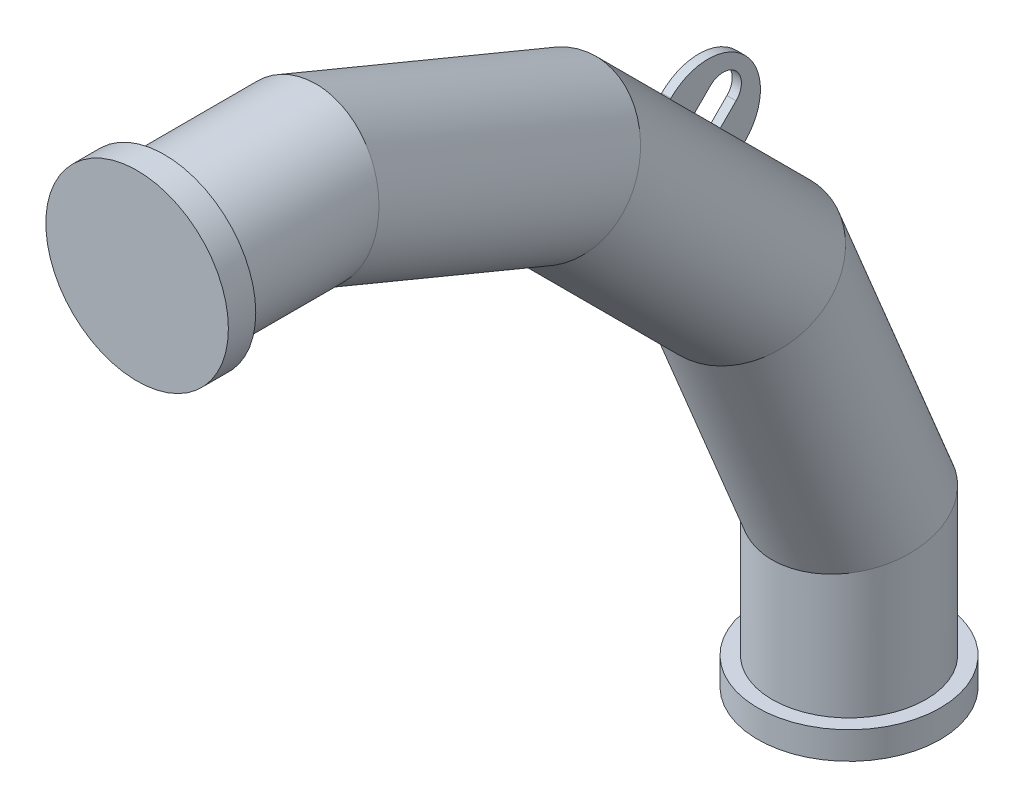
ISO-10303-21;
HEADER;
FILE_DESCRIPTION(('STEP AP214'),'2;1');
FILE_NAME('part.step','',(''),(''),'','','');
FILE_SCHEMA(('AUTOMOTIVE_DESIGN { 1 0 10303 214 1 1 1 1 }'));
ENDSEC;
DATA;
#1=APPLICATION_CONTEXT('core data for automotive mechanical design processes');
#2=APPLICATION_PROTOCOL_DEFINITION('international standard','automotive_design',2000,#1);
#3=PRODUCT_CONTEXT('',#1,'mechanical');
#4=PRODUCT('Part','Part','',(#3));
#5=PRODUCT_RELATED_PRODUCT_CATEGORY('part','',(#4));
#6=PRODUCT_DEFINITION_FORMATION('','',#4);
#7=PRODUCT_DEFINITION_CONTEXT('part definition',#1,'design');
#8=PRODUCT_DEFINITION('design','',#6,#7);
#9=PRODUCT_DEFINITION_SHAPE('','',#8);
#10=(LENGTH_UNIT() NAMED_UNIT(*) SI_UNIT(.MILLI.,.METRE.));
#11=(NAMED_UNIT(*) PLANE_ANGLE_UNIT() SI_UNIT($,.RADIAN.));
#12=(NAMED_UNIT(*) SI_UNIT($,.STERADIAN.) SOLID_ANGLE_UNIT());
#13=UNCERTAINTY_MEASURE_WITH_UNIT(LENGTH_MEASURE(1.E-05),#10,'distance_accuracy_value','');
#14=(GEOMETRIC_REPRESENTATION_CONTEXT(3) GLOBAL_UNCERTAINTY_ASSIGNED_CONTEXT((#13)) GLOBAL_UNIT_ASSIGNED_CONTEXT((#10,
#11,#12)) REPRESENTATION_CONTEXT('',''));
#15=CARTESIAN_POINT('',(0.,0.,0.));
#16=DIRECTION('',(0.,0.,1.));
#17=DIRECTION('',(1.,0.,0.));
#18=AXIS2_PLACEMENT_3D('',#15,#16,#17);
#19=CARTESIAN_POINT('',(0.,-325.159126987109,-665.81929876693));
#20=DIRECTION('',(0.,0.707106781186547,0.707106781186548));
#21=DIRECTION('',(0.,-0.707106781186548,0.707106781186547));
#22=AXIS2_PLACEMENT_3D('',#19,#20,#21);
#23=CYLINDRICAL_SURFACE('',#22,84.15);
#24=CARTESIAN_POINT('',(0.,-205.527778486358,-546.18795026618));
#25=DIRECTION('',(0.,0.707106781186549,0.707106781186549));
#26=DIRECTION('',(0.,-0.707106781186548,0.707106781186547));
#27=AXIS2_PLACEMENT_3D('',#24,#25,#26);
#28=CIRCLE('',#27,84.15);
#29=CARTESIAN_POINT('',(5.00000000000001,-146.129872378483,-605.585856374055));
#30=VERTEX_POINT('',#29);
#31=CARTESIAN_POINT('',(-4.99999999999999,-146.129872378483,-605.585856374055));
#32=VERTEX_POINT('',#31);
#33=EDGE_CURVE('E368',#30,#32,#28,.T.);
#34=ORIENTED_EDGE('',*,*,#33,.F.);
#35=DIRECTION('',(0.,0.707106781186547,0.707106781186548));
#36=VECTOR('',#35,1.);
#37=CARTESIAN_POINT('',(5.00000000000001,-265.761220879233,-725.217204874806));
#38=LINE('',#37,#36);
#39=CARTESIAN_POINT('',(5.00000000000001,-119.613368083987,-579.06935207956));
#40=VERTEX_POINT('',#39);
#41=EDGE_CURVE('E364',#30,#40,#38,.T.);
#42=ORIENTED_EDGE('',*,*,#41,.T.);
#43=CARTESIAN_POINT('',(0.,-179.011274191863,-519.671445971684));
#44=DIRECTION('',(0.,-0.707106781186548,-0.707106781186548));
#45=DIRECTION('',(0.,0.707106781186548,-0.707106781186548));
#46=AXIS2_PLACEMENT_3D('',#43,#44,#45);
#47=CIRCLE('',#46,84.15);
#48=CARTESIAN_POINT('',(-5.,-119.613368083987,-579.06935207956));
#49=VERTEX_POINT('',#48);
#50=EDGE_CURVE('E356',#49,#40,#47,.T.);
#51=ORIENTED_EDGE('',*,*,#50,.F.);
#52=DIRECTION('',(0.,0.707106781186547,0.707106781186548));
#53=VECTOR('',#52,1.);
#54=CARTESIAN_POINT('',(-5.,-265.761220879233,-725.217204874806));
#55=LINE('',#54,#53);
#56=EDGE_CURVE('E360',#32,#49,#55,.T.);
#57=ORIENTED_EDGE('',*,*,#56,.F.);
#58=EDGE_LOOP('',(#34,#42,#51,#57));
#59=FACE_BOUND('',#58,.T.);
#60=CARTESIAN_POINT('',(0.,-325.159126987114,-665.819298766927));
#61=DIRECTION('',(0.,0.831469612302548,0.555570233019599));
#62=DIRECTION('',(0.,-0.555570233019599,0.831469612302548));
#63=AXIS2_PLACEMENT_3D('',#60,#61,#62);
#64=ELLIPSE('',#63,85.79859596323,84.15);
#65=CARTESIAN_POINT('',(0.,-372.82627293916,-594.480373445277));
#66=VERTEX_POINT('',#65);
#67=EDGE_CURVE('E345',#66,#66,#64,.T.);
#68=ORIENTED_EDGE('',*,*,#67,.T.);
#69=EDGE_LOOP('',(#68));
#70=FACE_BOUND('',#69,.T.);
#71=CARTESIAN_POINT('',(0.,-114.18070123307,-454.840873012891));
#72=DIRECTION('',(0.,0.555570233019602,0.831469612302545));
#73=DIRECTION('',(0.,0.831469612302545,-0.555570233019602));
#74=AXIS2_PLACEMENT_3D('',#71,#72,#73);
#75=ELLIPSE('',#74,85.79859596323,84.15);
#76=CARTESIAN_POINT('',(0.,-42.8417759114201,-502.508018964937));
#77=VERTEX_POINT('',#76);
#78=EDGE_CURVE('E341',#77,#77,#75,.T.);
#79=ORIENTED_EDGE('',*,*,#78,.F.);
#80=EDGE_LOOP('',(#79));
#81=FACE_BOUND('',#80,.T.);
#82=CARTESIAN_POINT('',(0.,-233.81204973382,-574.472221513642));
#83=DIRECTION('',(0.,-0.707106781186548,-0.707106781186549));
#84=DIRECTION('',(0.,0.707106781186548,-0.707106781186547));
#85=AXIS2_PLACEMENT_3D('',#82,#83,#84);
#86=CIRCLE('',#85,84.15);
#87=CARTESIAN_POINT('',(-4.99999999999999,-174.414143625945,-633.870127621517));
#88=VERTEX_POINT('',#87);
#89=CARTESIAN_POINT('',(5.00000000000001,-174.414143625945,-633.870127621517));
#90=VERTEX_POINT('',#89);
#91=EDGE_CURVE('E11',#88,#90,#86,.T.);
#92=ORIENTED_EDGE('',*,*,#91,.F.);
#93=CARTESIAN_POINT('',(-5.,-200.93064792044,-660.386631916013));
#94=VERTEX_POINT('',#93);
#95=EDGE_CURVE('E365',#94,#88,#55,.T.);
#96=ORIENTED_EDGE('',*,*,#95,.F.);
#97=CARTESIAN_POINT('',(0.,-260.328554028316,-600.988725808137));
#98=DIRECTION('',(0.,0.707106781186548,0.707106781186548));
#99=DIRECTION('',(0.,-0.707106781186548,0.707106781186548));
#100=AXIS2_PLACEMENT_3D('',#97,#98,#99);
#101=CIRCLE('',#100,84.15);
#102=CARTESIAN_POINT('',(5.00000000000001,-200.93064792044,-660.386631916013));
#103=VERTEX_POINT('',#102);
#104=EDGE_CURVE('E371',#103,#94,#101,.T.);
#105=ORIENTED_EDGE('',*,*,#104,.F.);
#106=EDGE_CURVE('E28',#103,#90,#38,.T.);
#107=ORIENTED_EDGE('',*,*,#106,.T.);
#108=EDGE_LOOP('',(#92,#96,#105,#107));
#109=FACE_BOUND('',#108,.T.);
#110=ADVANCED_FACE('F18',(#59,#70,#81,#109),#23,.T.);
#111=CARTESIAN_POINT('',(0.,-600.815724465262,-779.999999999995));
#112=DIRECTION('',(0.,-1.,0.));
#113=DIRECTION('',(-1.,0.,0.));
#114=AXIS2_PLACEMENT_3D('',#111,#112,#113);
#115=CYLINDRICAL_SURFACE('',#114,84.15);
#116=CARTESIAN_POINT('',(0.,-750.000000000005,-779.999999999995));
#117=DIRECTION('',(0.,1.,0.));
#118=DIRECTION('',(1.,0.,0.));
#119=AXIS2_PLACEMENT_3D('',#116,#117,#118);
#120=CIRCLE('',#119,84.15);
#121=CARTESIAN_POINT('',(84.1500000000002,-750.000000000005,-779.999999999995));
#122=VERTEX_POINT('',#121);
#123=EDGE_CURVE('E336',#122,#122,#120,.T.);
#124=ORIENTED_EDGE('',*,*,#123,.T.);
#125=EDGE_LOOP('',(#124));
#126=FACE_BOUND('',#125,.T.);
#127=CARTESIAN_POINT('',(0.,-600.815724465262,-779.999999999995));
#128=DIRECTION('',(0.,0.980785280403231,0.195090322016124));
#129=DIRECTION('',(0.,-0.195090322016124,0.980785280403231));
#130=AXIS2_PLACEMENT_3D('',#127,#128,#129);
#131=ELLIPSE('',#130,85.79859596323,84.15);
#132=CARTESIAN_POINT('',(0.,-617.55420018026,-695.849999999995));
#133=VERTEX_POINT('',#132);
#134=EDGE_CURVE('E349',#133,#133,#131,.T.);
#135=ORIENTED_EDGE('',*,*,#134,.F.);
#136=EDGE_LOOP('',(#135));
#137=FACE_BOUND('',#136,.T.);
#138=ADVANCED_FACE('F20',(#126,#137),#115,.T.);
#139=CARTESIAN_POINT('',(0.,-325.159126987114,-665.819298766927));
#140=DIRECTION('',(0.,-0.923879532511289,-0.382683432365085));
#141=DIRECTION('',(0.,-0.382683432365085,0.923879532511289));
#142=AXIS2_PLACEMENT_3D('',#139,#140,#141);
#143=CYLINDRICAL_SURFACE('',#142,84.15);
#144=ORIENTED_EDGE('',*,*,#67,.F.);
#145=EDGE_LOOP('',(#144));
#146=FACE_BOUND('',#145,.T.);
#147=ORIENTED_EDGE('',*,*,#134,.T.);
#148=EDGE_LOOP('',(#147));
#149=FACE_BOUND('',#148,.T.);
#150=ADVANCED_FACE('F1005',(#146,#149),#143,.T.);
#151=CARTESIAN_POINT('',(0.,-114.18070123307,-454.840873012891));
#152=DIRECTION('',(0.,0.382683432365089,0.923879532511287));
#153=DIRECTION('',(0.,-0.923879532511287,0.382683432365089));
#154=AXIS2_PLACEMENT_3D('',#151,#152,#153);
#155=CYLINDRICAL_SURFACE('',#154,84.15);
#156=ORIENTED_EDGE('',*,*,#78,.T.);
#157=EDGE_LOOP('',(#156));
#158=FACE_BOUND('',#157,.T.);
#159=CARTESIAN_POINT('',(0.,0.,-179.184275534743));
#160=DIRECTION('',(0.,0.195090322016128,0.98078528040323));
#161=DIRECTION('',(0.,0.980785280403231,-0.195090322016128));
#162=AXIS2_PLACEMENT_3D('',#159,#160,#161);
#163=ELLIPSE('',#162,85.79859596323,84.15);
#164=CARTESIAN_POINT('',(0.,84.15,-195.922751249741));
#165=VERTEX_POINT('',#164);
#166=EDGE_CURVE('E337',#165,#165,#163,.T.);
#167=ORIENTED_EDGE('',*,*,#166,.F.);
#168=EDGE_LOOP('',(#167));
#169=FACE_BOUND('',#168,.T.);
#170=ADVANCED_FACE('F510',(#158,#169),#155,.T.);
#171=CARTESIAN_POINT('',(0.,0.,-179.184275534743));
#172=DIRECTION('',(0.,0.,1.));
#173=DIRECTION('',(1.,0.,0.));
#174=AXIS2_PLACEMENT_3D('',#171,#172,#173);
#175=CYLINDRICAL_SURFACE('',#174,84.15);
#176=CARTESIAN_POINT('',(0.,0.,-30.));
#177=DIRECTION('',(0.,0.,-1.));
#178=DIRECTION('',(-1.,0.,0.));
#179=AXIS2_PLACEMENT_3D('',#176,#177,#178);
#180=CIRCLE('',#179,84.15);
#181=CARTESIAN_POINT('',(-84.1500000000002,0.,-30.));
#182=VERTEX_POINT('',#181);
#183=EDGE_CURVE('E329',#182,#182,#180,.T.);
#184=ORIENTED_EDGE('',*,*,#183,.T.);
#185=EDGE_LOOP('',(#184));
#186=FACE_BOUND('',#185,.T.);
#187=ORIENTED_EDGE('',*,*,#166,.T.);
#188=EDGE_LOOP('',(#187));
#189=FACE_BOUND('',#188,.T.);
#190=ADVANCED_FACE('F504',(#186,#189),#175,.T.);
#191=CARTESIAN_POINT('',(0.,-750.000000000005,-779.999999999995));
#192=DIRECTION('',(0.,-1.,0.));
#193=DIRECTION('',(1.,0.,0.));
#194=AXIS2_PLACEMENT_3D('',#191,#192,#193);
#195=CYLINDRICAL_SURFACE('',#194,100.);
#196=CARTESIAN_POINT('',(0.,-750.000000000005,-779.999999999995));
#197=DIRECTION('',(0.,-1.,0.));
#198=DIRECTION('',(1.,0.,0.));
#199=AXIS2_PLACEMENT_3D('',#196,#197,#198);
#200=CIRCLE('',#199,100.);
#201=CARTESIAN_POINT('',(100.,-750.000000000005,-779.999999999995));
#202=VERTEX_POINT('',#201);
#203=EDGE_CURVE('E325',#202,#202,#200,.T.);
#204=ORIENTED_EDGE('',*,*,#203,.T.);
#205=EDGE_LOOP('',(#204));
#206=FACE_BOUND('',#205,.T.);
#207=CARTESIAN_POINT('',(0.,-780.000000000005,-779.999999999995));
#208=DIRECTION('',(0.,-1.,0.));
#209=DIRECTION('',(1.,0.,0.));
#210=AXIS2_PLACEMENT_3D('',#207,#208,#209);
#211=CIRCLE('',#210,100.);
#212=CARTESIAN_POINT('',(100.,-780.000000000005,-779.999999999995));
#213=VERTEX_POINT('',#212);
#214=EDGE_CURVE('E321',#213,#213,#211,.T.);
#215=ORIENTED_EDGE('',*,*,#214,.F.);
#216=EDGE_LOOP('',(#215));
#217=FACE_BOUND('',#216,.T.);
#218=ADVANCED_FACE('F509',(#206,#217),#195,.T.);
#219=CARTESIAN_POINT('',(0.,-750.000000000005,-779.999999999995));
#220=DIRECTION('',(0.,-1.,0.));
#221=DIRECTION('',(1.,0.,0.));
#222=AXIS2_PLACEMENT_3D('',#219,#220,#221);
#223=PLANE('',#222);
#224=ORIENTED_EDGE('',*,*,#123,.F.);
#225=EDGE_LOOP('',(#224));
#226=FACE_BOUND('',#225,.T.);
#227=ORIENTED_EDGE('',*,*,#203,.F.);
#228=EDGE_LOOP('',(#227));
#229=FACE_BOUND('',#228,.T.);
#230=ADVANCED_FACE('F529',(#226,#229),#223,.F.);
#231=CARTESIAN_POINT('',(0.,0.,-30.));
#232=DIRECTION('',(0.,0.,1.));
#233=DIRECTION('',(1.,0.,0.));
#234=AXIS2_PLACEMENT_3D('',#231,#232,#233);
#235=CYLINDRICAL_SURFACE('',#234,100.);
#236=CARTESIAN_POINT('',(0.,0.,-30.));
#237=DIRECTION('',(0.,0.,1.));
#238=DIRECTION('',(1.,0.,0.));
#239=AXIS2_PLACEMENT_3D('',#236,#237,#238);
#240=CIRCLE('',#239,100.);
#241=CARTESIAN_POINT('',(100.,0.,-30.));
#242=VERTEX_POINT('',#241);
#243=EDGE_CURVE('E318',#242,#242,#240,.T.);
#244=ORIENTED_EDGE('',*,*,#243,.T.);
#245=EDGE_LOOP('',(#244));
#246=FACE_BOUND('',#245,.T.);
#247=CARTESIAN_POINT('',(0.,0.,0.));
#248=DIRECTION('',(0.,0.,1.));
#249=DIRECTION('',(1.,0.,0.));
#250=AXIS2_PLACEMENT_3D('',#247,#248,#249);
#251=CIRCLE('',#250,100.);
#252=CARTESIAN_POINT('',(100.,0.,0.));
#253=VERTEX_POINT('',#252);
#254=EDGE_CURVE('E317',#253,#253,#251,.T.);
#255=ORIENTED_EDGE('',*,*,#254,.F.);
#256=EDGE_LOOP('',(#255));
#257=FACE_BOUND('',#256,.T.);
#258=ADVANCED_FACE('F538',(#246,#257),#235,.T.);
#259=CARTESIAN_POINT('',(0.,0.,-30.));
#260=DIRECTION('',(0.,0.,1.));
#261=DIRECTION('',(1.,0.,0.));
#262=AXIS2_PLACEMENT_3D('',#259,#260,#261);
#263=PLANE('',#262);
#264=ORIENTED_EDGE('',*,*,#183,.F.);
#265=EDGE_LOOP('',(#264));
#266=FACE_BOUND('',#265,.T.);
#267=ORIENTED_EDGE('',*,*,#243,.F.);
#268=EDGE_LOOP('',(#267));
#269=FACE_BOUND('',#268,.T.);
#270=ADVANCED_FACE('F549',(#266,#269),#263,.F.);
#271=CARTESIAN_POINT('',(5.00000000000001,-142.948828351349,-637.051171648651));
#272=DIRECTION('',(1.,0.,0.));
#273=DIRECTION('',(0.,0.707106781186549,-0.707106781186548));
#274=AXIS2_PLACEMENT_3D('',#271,#272,#273);
#275=PLANE('',#274);
#276=ORIENTED_EDGE('',*,*,#106,.F.);
#277=DIRECTION('',(0.,0.707106781186548,-0.707106781186548));
#278=VECTOR('',#277,1.);
#279=CARTESIAN_POINT('',(5.00000000000001,-207.295545439325,-654.021734397128));
#280=LINE('',#279,#278);
#281=CARTESIAN_POINT('',(5.00000000000001,-200.224477627459,-661.092802208994));
#282=VERTEX_POINT('',#281);
#283=EDGE_CURVE('E267',#103,#282,#280,.T.);
#284=ORIENTED_EDGE('',*,*,#283,.T.);
#285=CARTESIAN_POINT('',(5.00000000000001,-159.565837709233,-620.434162290767));
#286=DIRECTION('',(1.,0.,0.));
#287=DIRECTION('',(0.,0.707106781186549,-0.707106781186548));
#288=AXIS2_PLACEMENT_3D('',#285,#286,#287);
#289=CIRCLE('',#288,57.5);
#290=CARTESIAN_POINT('',(5.00000000000001,-118.907197791006,-579.775522372541));
#291=VERTEX_POINT('',#290);
#292=EDGE_CURVE('E285',#282,#291,#289,.T.);
#293=ORIENTED_EDGE('',*,*,#292,.T.);
#294=DIRECTION('',(0.,0.707106781186548,-0.707106781186548));
#295=VECTOR('',#294,1.);
#296=CARTESIAN_POINT('',(5.00000000000001,-125.978265602872,-572.704454560675));
#297=LINE('',#296,#295);
#298=EDGE_CURVE('E258',#40,#291,#297,.T.);
#299=ORIENTED_EDGE('',*,*,#298,.F.);
#300=ORIENTED_EDGE('',*,*,#41,.F.);
#301=DIRECTION('',(0.,0.707106781186549,-0.707106781186549));
#302=VECTOR('',#301,1.);
#303=CARTESIAN_POINT('',(5.00000000000001,-145.423702085502,-606.292026667036));
#304=LINE('',#303,#302);
#305=CARTESIAN_POINT('',(5.00000000000001,-128.806692727618,-622.90903602492));
#306=VERTEX_POINT('',#305);
#307=EDGE_CURVE('E274',#30,#306,#304,.T.);
#308=ORIENTED_EDGE('',*,*,#307,.T.);
#309=CARTESIAN_POINT('',(5.00000000000001,-142.948828351349,-637.051171648651));
#310=DIRECTION('',(-1.,0.,0.));
#311=DIRECTION('',(0.,0.707106781186549,-0.707106781186548));
#312=AXIS2_PLACEMENT_3D('',#309,#310,#311);
#313=CIRCLE('',#312,20.);
#314=CARTESIAN_POINT('',(5.00000000000001,-157.09096397508,-651.193307272382));
#315=VERTEX_POINT('',#314);
#316=EDGE_CURVE('E277',#306,#315,#313,.T.);
#317=ORIENTED_EDGE('',*,*,#316,.T.);
#318=DIRECTION('',(0.,-0.707106781186549,0.707106781186548));
#319=VECTOR('',#318,1.);
#320=CARTESIAN_POINT('',(5.00000000000001,-173.707973332964,-634.576297914498));
#321=LINE('',#320,#319);
#322=EDGE_CURVE('E281',#315,#90,#321,.T.);
#323=ORIENTED_EDGE('',*,*,#322,.T.);
#324=EDGE_LOOP('',(#276,#284,#293,#299,#300,#308,#317,#323));
#325=FACE_BOUND('',#324,.T.);
#326=ADVANCED_FACE('F560',(#325),#275,.T.);
#327=CARTESIAN_POINT('',(-5.,-142.948828351349,-637.051171648651));
#328=DIRECTION('',(1.,0.,0.));
#329=DIRECTION('',(0.,0.707106781186549,-0.707106781186548));
#330=AXIS2_PLACEMENT_3D('',#327,#328,#329);
#331=PLANE('',#330);
#332=DIRECTION('',(0.,0.707106781186548,-0.707106781186548));
#333=VECTOR('',#332,1.);
#334=CARTESIAN_POINT('',(-5.,-207.295545439325,-654.021734397128));
#335=LINE('',#334,#333);
#336=CARTESIAN_POINT('',(-5.,-200.22447762746,-661.092802208994));
#337=VERTEX_POINT('',#336);
#338=EDGE_CURVE('E270',#94,#337,#335,.T.);
#339=ORIENTED_EDGE('',*,*,#338,.F.);
#340=ORIENTED_EDGE('',*,*,#95,.T.);
#341=DIRECTION('',(0.,-0.707106781186549,0.707106781186548));
#342=VECTOR('',#341,1.);
#343=CARTESIAN_POINT('',(-5.,-173.707973332964,-634.576297914498));
#344=LINE('',#343,#342);
#345=CARTESIAN_POINT('',(-5.,-157.09096397508,-651.193307272382));
#346=VERTEX_POINT('',#345);
#347=EDGE_CURVE('E295',#346,#88,#344,.T.);
#348=ORIENTED_EDGE('',*,*,#347,.F.);
#349=CARTESIAN_POINT('',(-5.,-142.948828351349,-637.051171648651));
#350=DIRECTION('',(-1.,0.,0.));
#351=DIRECTION('',(0.,0.707106781186549,-0.707106781186548));
#352=AXIS2_PLACEMENT_3D('',#349,#350,#351);
#353=CIRCLE('',#352,20.);
#354=CARTESIAN_POINT('',(-5.,-128.806692727618,-622.90903602492));
#355=VERTEX_POINT('',#354);
#356=EDGE_CURVE('E292',#355,#346,#353,.T.);
#357=ORIENTED_EDGE('',*,*,#356,.F.);
#358=DIRECTION('',(0.,0.707106781186549,-0.707106781186549));
#359=VECTOR('',#358,1.);
#360=CARTESIAN_POINT('',(-5.,-145.423702085502,-606.292026667036));
#361=LINE('',#360,#359);
#362=EDGE_CURVE('E273',#32,#355,#361,.T.);
#363=ORIENTED_EDGE('',*,*,#362,.F.);
#364=ORIENTED_EDGE('',*,*,#56,.T.);
#365=DIRECTION('',(0.,0.707106781186548,-0.707106781186548));
#366=VECTOR('',#365,1.);
#367=CARTESIAN_POINT('',(-5.,-125.978265602872,-572.704454560675));
#368=LINE('',#367,#366);
#369=CARTESIAN_POINT('',(-5.,-118.907197791006,-579.775522372541));
#370=VERTEX_POINT('',#369);
#371=EDGE_CURVE('E264',#49,#370,#368,.T.);
#372=ORIENTED_EDGE('',*,*,#371,.T.);
#373=CARTESIAN_POINT('',(-5.,-159.565837709233,-620.434162290767));
#374=DIRECTION('',(1.,0.,0.));
#375=DIRECTION('',(0.,0.707106781186549,-0.707106781186548));
#376=AXIS2_PLACEMENT_3D('',#373,#374,#375);
#377=CIRCLE('',#376,57.5);
#378=EDGE_CURVE('E278',#337,#370,#377,.T.);
#379=ORIENTED_EDGE('',*,*,#378,.F.);
#380=EDGE_LOOP('',(#339,#340,#348,#357,#363,#364,#372,#379));
#381=FACE_BOUND('',#380,.T.);
#382=ADVANCED_FACE('F570',(#381),#331,.F.);
#383=CARTESIAN_POINT('',(5.00000000000001,-145.423702085502,-606.292026667036));
#384=DIRECTION('',(0.,0.707106781186549,0.707106781186549));
#385=DIRECTION('',(0.,-0.707106781186549,0.707106781186549));
#386=AXIS2_PLACEMENT_3D('',#383,#384,#385);
#387=PLANE('',#386);
#388=ORIENTED_EDGE('',*,*,#307,.F.);
#389=ORIENTED_EDGE('',*,*,#33,.T.);
#390=ORIENTED_EDGE('',*,*,#362,.T.);
#391=DIRECTION('',(-1.,0.,0.));
#392=VECTOR('',#391,1.);
#393=CARTESIAN_POINT('',(5.00000000000001,-128.806692727618,-622.90903602492));
#394=LINE('',#393,#392);
#395=EDGE_CURVE('E313',#306,#355,#394,.T.);
#396=ORIENTED_EDGE('',*,*,#395,.F.);
#397=EDGE_LOOP('',(#388,#389,#390,#396));
#398=FACE_BOUND('',#397,.T.);
#399=ADVANCED_FACE('F580',(#398),#387,.F.);
#400=CARTESIAN_POINT('',(5.00000000000001,-142.948828351349,-637.051171648651));
#401=DIRECTION('',(-1.,0.,0.));
#402=DIRECTION('',(0.,-0.707106781186549,0.707106781186548));
#403=AXIS2_PLACEMENT_3D('',#400,#401,#402);
#404=CYLINDRICAL_SURFACE('',#403,20.);
#405=ORIENTED_EDGE('',*,*,#356,.T.);
#406=DIRECTION('',(-1.,0.,0.));
#407=VECTOR('',#406,1.);
#408=CARTESIAN_POINT('',(5.00000000000001,-157.09096397508,-651.193307272382));
#409=LINE('',#408,#407);
#410=EDGE_CURVE('E309',#315,#346,#409,.T.);
#411=ORIENTED_EDGE('',*,*,#410,.F.);
#412=ORIENTED_EDGE('',*,*,#316,.F.);
#413=ORIENTED_EDGE('',*,*,#395,.T.);
#414=EDGE_LOOP('',(#405,#411,#412,#413));
#415=FACE_BOUND('',#414,.T.);
#416=ADVANCED_FACE('F489',(#415),#404,.F.);
#417=CARTESIAN_POINT('',(5.00000000000001,-173.707973332964,-634.576297914498));
#418=DIRECTION('',(0.,-0.707106781186548,-0.707106781186549));
#419=DIRECTION('',(0.,0.707106781186549,-0.707106781186548));
#420=AXIS2_PLACEMENT_3D('',#417,#418,#419);
#421=PLANE('',#420);
#422=ORIENTED_EDGE('',*,*,#347,.T.);
#423=ORIENTED_EDGE('',*,*,#91,.T.);
#424=ORIENTED_EDGE('',*,*,#322,.F.);
#425=ORIENTED_EDGE('',*,*,#410,.T.);
#426=EDGE_LOOP('',(#422,#423,#424,#425));
#427=FACE_BOUND('',#426,.T.);
#428=ADVANCED_FACE('F482',(#427),#421,.F.);
#429=CARTESIAN_POINT('',(5.00000000000001,-159.565837709233,-620.434162290767));
#430=DIRECTION('',(-1.,0.,0.));
#431=DIRECTION('',(0.,-0.707106781186549,0.707106781186548));
#432=AXIS2_PLACEMENT_3D('',#429,#430,#431);
#433=CYLINDRICAL_SURFACE('',#432,57.5);
#434=ORIENTED_EDGE('',*,*,#378,.T.);
#435=DIRECTION('',(-1.,0.,0.));
#436=VECTOR('',#435,1.);
#437=CARTESIAN_POINT('',(5.00000000000001,-118.907197791006,-579.775522372541));
#438=LINE('',#437,#436);
#439=EDGE_CURVE('E289',#291,#370,#438,.T.);
#440=ORIENTED_EDGE('',*,*,#439,.F.);
#441=ORIENTED_EDGE('',*,*,#292,.F.);
#442=DIRECTION('',(-1.,0.,0.));
#443=VECTOR('',#442,1.);
#444=CARTESIAN_POINT('',(5.00000000000001,-200.224477627459,-661.092802208994));
#445=LINE('',#444,#443);
#446=EDGE_CURVE('E305',#282,#337,#445,.T.);
#447=ORIENTED_EDGE('',*,*,#446,.T.);
#448=EDGE_LOOP('',(#434,#440,#441,#447));
#449=FACE_BOUND('',#448,.T.);
#450=ADVANCED_FACE('F488',(#449),#433,.T.);
#451=CARTESIAN_POINT('',(-5.,-207.295545439325,-654.021734397128));
#452=DIRECTION('',(0.,0.707106781186548,0.707106781186548));
#453=DIRECTION('',(0.,-0.707106781186548,0.707106781186548));
#454=AXIS2_PLACEMENT_3D('',#451,#452,#453);
#455=PLANE('',#454);
#456=ORIENTED_EDGE('',*,*,#283,.F.);
#457=ORIENTED_EDGE('',*,*,#104,.T.);
#458=ORIENTED_EDGE('',*,*,#338,.T.);
#459=ORIENTED_EDGE('',*,*,#446,.F.);
#460=EDGE_LOOP('',(#456,#457,#458,#459));
#461=FACE_BOUND('',#460,.T.);
#462=ADVANCED_FACE('F608',(#461),#455,.F.);
#463=CARTESIAN_POINT('',(5.00000000000001,-125.978265602872,-572.704454560675));
#464=DIRECTION('',(0.,-0.707106781186548,-0.707106781186548));
#465=DIRECTION('',(0.,0.707106781186548,-0.707106781186548));
#466=AXIS2_PLACEMENT_3D('',#463,#464,#465);
#467=PLANE('',#466);
#468=ORIENTED_EDGE('',*,*,#371,.F.);
#469=ORIENTED_EDGE('',*,*,#50,.T.);
#470=ORIENTED_EDGE('',*,*,#298,.T.);
#471=ORIENTED_EDGE('',*,*,#439,.T.);
#472=EDGE_LOOP('',(#468,#469,#470,#471));
#473=FACE_BOUND('',#472,.T.);
#474=ADVANCED_FACE('F614',(#473),#467,.F.);
#475=CARTESIAN_POINT('',(0.,0.,0.));
#476=DIRECTION('',(0.,0.,1.));
#477=DIRECTION('',(1.,0.,0.));
#478=AXIS2_PLACEMENT_3D('',#475,#476,#477);
#479=PLANE('',#478);
#480=ORIENTED_EDGE('',*,*,#254,.T.);
#481=EDGE_LOOP('',(#480));
#482=FACE_BOUND('',#481,.T.);
#483=ADVANCED_FACE('F620',(#482),#479,.T.);
#484=CARTESIAN_POINT('',(0.,-780.000000000005,-779.999999999995));
#485=DIRECTION('',(0.,-1.,0.));
#486=DIRECTION('',(1.,0.,0.));
#487=AXIS2_PLACEMENT_3D('',#484,#485,#486);
#488=PLANE('',#487);
#489=ORIENTED_EDGE('',*,*,#214,.T.);
#490=EDGE_LOOP('',(#489));
#491=FACE_BOUND('',#490,.T.);
#492=ADVANCED_FACE('F627',(#491),#488,.T.);
#493=CLOSED_SHELL('',(#110,#138,#150,#170,#190,#218,#230,#258,#270,#326,#382,#399,#416,#428,
#450,#462,#474,#483,#492));
#494=CARTESIAN_POINT('',(0.,0.,-30.));
#495=DIRECTION('',(0.,0.,1.));
#496=DIRECTION('',(1.,0.,0.));
#497=AXIS2_PLACEMENT_3D('',#494,#495,#496);
#498=PLANE('',#497);
#499=CARTESIAN_POINT('',(0.,0.,-30.));
#500=DIRECTION('',(0.,0.,1.));
#501=DIRECTION('',(1.,0.,0.));
#502=AXIS2_PLACEMENT_3D('',#499,#500,#501);
#503=CIRCLE('',#502,39.5);
#504=CARTESIAN_POINT('',(39.5,0.,-30.));
#505=VERTEX_POINT('',#504);
#506=EDGE_CURVE('E199',#505,#505,#503,.T.);
#507=ORIENTED_EDGE('',*,*,#506,.T.);
#508=EDGE_LOOP('',(#507));
#509=FACE_BOUND('',#508,.T.);
#510=CARTESIAN_POINT('',(0.,0.,-30.));
#511=DIRECTION('',(0.,0.,-1.));
#512=DIRECTION('',(0.,1.,0.));
#513=AXIS2_PLACEMENT_3D('',#510,#511,#512);
#514=CIRCLE('',#513,40.);
#515=CARTESIAN_POINT('',(0.,39.9999999999974,-30.0000000000003));
#516=VERTEX_POINT('',#515);
#517=EDGE_CURVE('E254',#516,#516,#514,.T.);
#518=ORIENTED_EDGE('',*,*,#517,.T.);
#519=EDGE_LOOP('',(#518));
#520=FACE_BOUND('',#519,.T.);
#521=ADVANCED_FACE('F638',(#509,#520),#498,.F.);
#522=CARTESIAN_POINT('',(0.,-750.000000000003,-29.9999999999949));
#523=DIRECTION('',(1.,0.,0.));
#524=DIRECTION('',(0.,-1.,0.));
#525=AXIS2_PLACEMENT_3D('',#522,#523,#524);
#526=TOROIDAL_SURFACE('',#525,750.,40.);
#527=CARTESIAN_POINT('',(0.,-750.000000000005,-779.999999999995));
#528=DIRECTION('',(0.,1.,0.));
#529=DIRECTION('',(0.,0.,-1.));
#530=AXIS2_PLACEMENT_3D('',#527,#528,#529);
#531=CIRCLE('',#530,40.);
#532=CARTESIAN_POINT('',(0.,-750.000000000005,-819.999999999995));
#533=VERTEX_POINT('',#532);
#534=EDGE_CURVE('E253',#533,#533,#531,.T.);
#535=CARTESIAN_POINT('',(0.,-750.000000000003,-29.9999999999949));
#536=DIRECTION('',(1.,0.,0.));
#537=DIRECTION('',(0.,-1.,0.));
#538=AXIS2_PLACEMENT_3D('',#535,#536,#537);
#539=CIRCLE('',#538,790.);
#540=EDGE_CURVE('',#533,#516,#539,.T.);
#541=ORIENTED_EDGE('',*,*,#534,.F.);
#542=ORIENTED_EDGE('',*,*,#517,.F.);
#543=ORIENTED_EDGE('',*,*,#540,.T.);
#544=ORIENTED_EDGE('',*,*,#540,.F.);
#545=EDGE_LOOP('',(#541,#543,#542,#544));
#546=FACE_BOUND('',#545,.T.);
#547=ADVANCED_FACE('F641',(#546),#526,.F.);
#548=CARTESIAN_POINT('',(0.,-750.000000000005,-779.999999999995));
#549=DIRECTION('',(0.,-1.,0.));
#550=DIRECTION('',(1.,0.,0.));
#551=AXIS2_PLACEMENT_3D('',#548,#549,#550);
#552=PLANE('',#551);
#553=CARTESIAN_POINT('',(0.,-750.000000000005,-779.999999999995));
#554=DIRECTION('',(0.,-1.,0.));
#555=DIRECTION('',(1.,0.,0.));
#556=AXIS2_PLACEMENT_3D('',#553,#554,#555);
#557=CIRCLE('',#556,39.5);
#558=CARTESIAN_POINT('',(39.5,-750.000000000005,-779.999999999995));
#559=VERTEX_POINT('',#558);
#560=EDGE_CURVE('E427',#559,#559,#557,.T.);
#561=ORIENTED_EDGE('',*,*,#560,.T.);
#562=EDGE_LOOP('',(#561));
#563=FACE_BOUND('',#562,.T.);
#564=ORIENTED_EDGE('',*,*,#534,.T.);
#565=EDGE_LOOP('',(#564));
#566=FACE_BOUND('',#565,.T.);
#567=ADVANCED_FACE('F648',(#563,#566),#552,.F.);
#568=CARTESIAN_POINT('',(0.,-755.000000000005,-779.999999999995));
#569=DIRECTION('',(0.,-1.,0.));
#570=DIRECTION('',(0.,0.,-1.));
#571=AXIS2_PLACEMENT_3D('',#568,#569,#570);
#572=PLANE('',#571);
#573=CARTESIAN_POINT('',(0.,-755.000000000005,-779.999999999995));
#574=DIRECTION('',(0.,-1.,0.));
#575=DIRECTION('',(0.,0.,-1.));
#576=AXIS2_PLACEMENT_3D('',#573,#574,#575);
#577=CIRCLE('',#576,39.5);
#578=CARTESIAN_POINT('',(0.,-755.000000000005,-819.499999999995));
#579=VERTEX_POINT('',#578);
#580=EDGE_CURVE('E192',#579,#579,#577,.F.);
#581=ORIENTED_EDGE('',*,*,#580,.T.);
#582=EDGE_LOOP('',(#581));
#583=FACE_BOUND('',#582,.T.);
#584=ADVANCED_FACE('F655',(#583),#572,.F.);
#585=CARTESIAN_POINT('',(0.,-750.000000000005,-779.999999999995));
#586=DIRECTION('',(0.,-1.,0.));
#587=DIRECTION('',(1.,0.,0.));
#588=AXIS2_PLACEMENT_3D('',#585,#586,#587);
#589=CYLINDRICAL_SURFACE('',#588,39.5);
#590=ORIENTED_EDGE('',*,*,#560,.F.);
#591=EDGE_LOOP('',(#590));
#592=FACE_BOUND('',#591,.T.);
#593=ORIENTED_EDGE('',*,*,#580,.F.);
#594=EDGE_LOOP('',(#593));
#595=FACE_BOUND('',#594,.T.);
#596=ADVANCED_FACE('F465',(#592,#595),#589,.F.);
#597=CARTESIAN_POINT('',(0.,0.,-25.));
#598=DIRECTION('',(0.,0.,1.));
#599=DIRECTION('',(1.,0.,0.));
#600=AXIS2_PLACEMENT_3D('',#597,#598,#599);
#601=PLANE('',#600);
#602=CARTESIAN_POINT('',(0.,0.,-25.));
#603=DIRECTION('',(0.,0.,1.));
#604=DIRECTION('',(1.,0.,0.));
#605=AXIS2_PLACEMENT_3D('',#602,#603,#604);
#606=CIRCLE('',#605,39.5);
#607=CARTESIAN_POINT('',(39.5,0.,-25.));
#608=VERTEX_POINT('',#607);
#609=EDGE_CURVE('E198',#608,#608,#606,.F.);
#610=ORIENTED_EDGE('',*,*,#609,.T.);
#611=EDGE_LOOP('',(#610));
#612=FACE_BOUND('',#611,.T.);
#613=ADVANCED_FACE('F458',(#612),#601,.F.);
#614=CARTESIAN_POINT('',(0.,0.,-30.));
#615=DIRECTION('',(0.,0.,1.));
#616=DIRECTION('',(1.,0.,0.));
#617=AXIS2_PLACEMENT_3D('',#614,#615,#616);
#618=CYLINDRICAL_SURFACE('',#617,39.5);
#619=ORIENTED_EDGE('',*,*,#506,.F.);
#620=EDGE_LOOP('',(#619));
#621=FACE_BOUND('',#620,.T.);
#622=ORIENTED_EDGE('',*,*,#609,.F.);
#623=EDGE_LOOP('',(#622));
#624=FACE_BOUND('',#623,.T.);
#625=ADVANCED_FACE('F464',(#621,#624),#618,.F.);
#626=CLOSED_SHELL('',(#521,#547,#567,#584,#596,#613,#625));
#627=CARTESIAN_POINT('',(-30.614674589207,-73.910362600903,-23.9999999999999));
#628=DIRECTION('',(0.,0.,1.));
#629=DIRECTION('',(0.,-1.,0.));
#630=AXIS2_PLACEMENT_3D('',#627,#628,#629);
#631=PLANE('',#630);
#632=CARTESIAN_POINT('',(-30.614674589207,-73.910362600903,-23.9999999999999));
#633=DIRECTION('',(0.,0.,1.));
#634=DIRECTION('',(1.,0.,0.));
#635=AXIS2_PLACEMENT_3D('',#632,#633,#634);
#636=CIRCLE('',#635,6.99999999999999);
#637=CARTESIAN_POINT('',(-23.614674589207,-73.910362600903,-23.9999999999999));
#638=VERTEX_POINT('',#637);
#639=EDGE_CURVE('E206',#638,#638,#636,.T.);
#640=ORIENTED_EDGE('',*,*,#639,.F.);
#641=EDGE_LOOP('',(#640));
#642=FACE_BOUND('',#641,.T.);
#643=ADVANCED_FACE('F674',(#642),#631,.F.);
#644=CARTESIAN_POINT('',(-30.614674589207,-73.910362600903,-23.9999999999999));
#645=DIRECTION('',(0.,0.,1.));
#646=DIRECTION('',(1.,0.,0.));
#647=AXIS2_PLACEMENT_3D('',#644,#645,#646);
#648=CONICAL_SURFACE('',#647,6.99999999999999,1.02974425867665);
#649=CARTESIAN_POINT('',(-30.614674589207,-73.910362600903,-28.2060243331928));
#650=VERTEX_POINT('',#649);
#651=VERTEX_LOOP('',#650);
#652=FACE_BOUND('',#651,.T.);
#653=ORIENTED_EDGE('',*,*,#639,.T.);
#654=EDGE_LOOP('',(#653));
#655=FACE_BOUND('',#654,.T.);
#656=ADVANCED_FACE('F677',(#652,#655),#648,.F.);
#657=CLOSED_SHELL('',(#643,#656));
#658=CARTESIAN_POINT('',(30.6146745892075,-73.9103626009028,-23.9999999999998));
#659=DIRECTION('',(0.,0.,1.));
#660=DIRECTION('',(0.,-1.,0.));
#661=AXIS2_PLACEMENT_3D('',#658,#659,#660);
#662=PLANE('',#661);
#663=CARTESIAN_POINT('',(30.6146745892075,-73.9103626009028,-23.9999999999998));
#664=DIRECTION('',(0.,0.,1.));
#665=DIRECTION('',(1.,0.,0.));
#666=AXIS2_PLACEMENT_3D('',#663,#664,#665);
#667=CIRCLE('',#666,6.99999999999999);
#668=CARTESIAN_POINT('',(37.6146745892075,-73.9103626009028,-23.9999999999998));
#669=VERTEX_POINT('',#668);
#670=EDGE_CURVE('E211',#669,#669,#667,.T.);
#671=ORIENTED_EDGE('',*,*,#670,.F.);
#672=EDGE_LOOP('',(#671));
#673=FACE_BOUND('',#672,.T.);
#674=ADVANCED_FACE('F690',(#673),#662,.F.);
#675=CARTESIAN_POINT('',(30.6146745892075,-73.9103626009028,-23.9999999999998));
#676=DIRECTION('',(0.,0.,1.));
#677=DIRECTION('',(1.,0.,0.));
#678=AXIS2_PLACEMENT_3D('',#675,#676,#677);
#679=CONICAL_SURFACE('',#678,6.99999999999999,1.02974425867665);
#680=CARTESIAN_POINT('',(30.6146745892075,-73.9103626009028,-28.2060243331928));
#681=VERTEX_POINT('',#680);
#682=VERTEX_LOOP('',#681);
#683=FACE_BOUND('',#682,.T.);
#684=ORIENTED_EDGE('',*,*,#670,.T.);
#685=EDGE_LOOP('',(#684));
#686=FACE_BOUND('',#685,.T.);
#687=ADVANCED_FACE('F693',(#683,#686),#679,.F.);
#688=CLOSED_SHELL('',(#674,#687));
#689=CARTESIAN_POINT('',(73.9103626009031,-30.6146745892068,-24.));
#690=DIRECTION('',(0.,0.,1.));
#691=DIRECTION('',(0.,-1.,0.));
#692=AXIS2_PLACEMENT_3D('',#689,#690,#691);
#693=PLANE('',#692);
#694=CARTESIAN_POINT('',(73.9103626009031,-30.6146745892068,-24.));
#695=DIRECTION('',(0.,0.,1.));
#696=DIRECTION('',(1.,0.,0.));
#697=AXIS2_PLACEMENT_3D('',#694,#695,#696);
#698=CIRCLE('',#697,7.);
#699=CARTESIAN_POINT('',(80.9103626009031,-30.6146745892068,-24.));
#700=VERTEX_POINT('',#699);
#701=EDGE_CURVE('E185',#700,#700,#698,.T.);
#702=ORIENTED_EDGE('',*,*,#701,.F.);
#703=EDGE_LOOP('',(#702));
#704=FACE_BOUND('',#703,.T.);
#705=ADVANCED_FACE('F705',(#704),#693,.F.);
#706=CARTESIAN_POINT('',(73.9103626009031,-30.6146745892068,-24.));
#707=DIRECTION('',(0.,0.,1.));
#708=DIRECTION('',(1.,0.,0.));
#709=AXIS2_PLACEMENT_3D('',#706,#707,#708);
#710=CONICAL_SURFACE('',#709,7.,1.02974425867665);
#711=CARTESIAN_POINT('',(73.9103626009031,-30.6146745892067,-28.206024333193));
#712=VERTEX_POINT('',#711);
#713=VERTEX_LOOP('',#712);
#714=FACE_BOUND('',#713,.T.);
#715=ORIENTED_EDGE('',*,*,#701,.T.);
#716=EDGE_LOOP('',(#715));
#717=FACE_BOUND('',#716,.T.);
#718=ADVANCED_FACE('F708',(#714,#717),#710,.F.);
#719=CLOSED_SHELL('',(#705,#718));
#720=CARTESIAN_POINT('',(73.9103626009026,30.6146745892078,-24.));
#721=DIRECTION('',(0.,0.,1.));
#722=DIRECTION('',(0.,-1.,0.));
#723=AXIS2_PLACEMENT_3D('',#720,#721,#722);
#724=PLANE('',#723);
#725=CARTESIAN_POINT('',(73.9103626009026,30.6146745892078,-24.));
#726=DIRECTION('',(0.,0.,1.));
#727=DIRECTION('',(1.,0.,0.));
#728=AXIS2_PLACEMENT_3D('',#725,#726,#727);
#729=CIRCLE('',#728,7.);
#730=CARTESIAN_POINT('',(80.9103626009026,30.6146745892078,-24.));
#731=VERTEX_POINT('',#730);
#732=EDGE_CURVE('E176',#731,#731,#729,.T.);
#733=ORIENTED_EDGE('',*,*,#732,.F.);
#734=EDGE_LOOP('',(#733));
#735=FACE_BOUND('',#734,.T.);
#736=ADVANCED_FACE('F721',(#735),#724,.F.);
#737=CARTESIAN_POINT('',(73.9103626009026,30.6146745892078,-24.));
#738=DIRECTION('',(0.,0.,1.));
#739=DIRECTION('',(1.,0.,0.));
#740=AXIS2_PLACEMENT_3D('',#737,#738,#739);
#741=CONICAL_SURFACE('',#740,7.,1.02974425867665);
#742=CARTESIAN_POINT('',(73.9103626009027,30.6146745892078,-28.2060243331929));
#743=VERTEX_POINT('',#742);
#744=VERTEX_LOOP('',#743);
#745=FACE_BOUND('',#744,.T.);
#746=ORIENTED_EDGE('',*,*,#732,.T.);
#747=EDGE_LOOP('',(#746));
#748=FACE_BOUND('',#747,.T.);
#749=ADVANCED_FACE('F724',(#745,#748),#741,.F.);
#750=CLOSED_SHELL('',(#736,#749));
#751=CARTESIAN_POINT('',(30.6146745892065,73.9103626009032,-24.));
#752=DIRECTION('',(0.,0.,1.));
#753=DIRECTION('',(0.,-1.,0.));
#754=AXIS2_PLACEMENT_3D('',#751,#752,#753);
#755=PLANE('',#754);
#756=CARTESIAN_POINT('',(30.6146745892065,73.9103626009032,-24.));
#757=DIRECTION('',(0.,0.,1.));
#758=DIRECTION('',(1.,0.,0.));
#759=AXIS2_PLACEMENT_3D('',#756,#757,#758);
#760=CIRCLE('',#759,6.99999999999999);
#761=CARTESIAN_POINT('',(37.6146745892065,73.9103626009032,-24.));
#762=VERTEX_POINT('',#761);
#763=EDGE_CURVE('E173',#762,#762,#760,.T.);
#764=ORIENTED_EDGE('',*,*,#763,.F.);
#765=EDGE_LOOP('',(#764));
#766=FACE_BOUND('',#765,.T.);
#767=ADVANCED_FACE('F167',(#766),#755,.F.);
#768=CARTESIAN_POINT('',(30.6146745892065,73.9103626009032,-24.));
#769=DIRECTION('',(0.,0.,1.));
#770=DIRECTION('',(1.,0.,0.));
#771=AXIS2_PLACEMENT_3D('',#768,#769,#770);
#772=CONICAL_SURFACE('',#771,6.99999999999999,1.02974425867665);
#773=CARTESIAN_POINT('',(30.6146745892065,73.9103626009032,-28.206024333193));
#774=VERTEX_POINT('',#773);
#775=VERTEX_LOOP('',#774);
#776=FACE_BOUND('',#775,.T.);
#777=ORIENTED_EDGE('',*,*,#763,.T.);
#778=EDGE_LOOP('',(#777));
#779=FACE_BOUND('',#778,.T.);
#780=ADVANCED_FACE('F164',(#776,#779),#772,.F.);
#781=CLOSED_SHELL('',(#767,#780));
#782=CARTESIAN_POINT('',(-30.614674589208,73.9103626009027,-24.));
#783=DIRECTION('',(0.,0.,1.));
#784=DIRECTION('',(0.,-1.,0.));
#785=AXIS2_PLACEMENT_3D('',#782,#783,#784);
#786=PLANE('',#785);
#787=CARTESIAN_POINT('',(-30.614674589208,73.9103626009027,-24.));
#788=DIRECTION('',(0.,0.,1.));
#789=DIRECTION('',(1.,0.,0.));
#790=AXIS2_PLACEMENT_3D('',#787,#788,#789);
#791=CIRCLE('',#790,6.99999999999999);
#792=CARTESIAN_POINT('',(-23.614674589208,73.9103626009027,-24.));
#793=VERTEX_POINT('',#792);
#794=EDGE_CURVE('E177',#793,#793,#791,.T.);
#795=ORIENTED_EDGE('',*,*,#794,.F.);
#796=EDGE_LOOP('',(#795));
#797=FACE_BOUND('',#796,.T.);
#798=ADVANCED_FACE('F743',(#797),#786,.F.);
#799=CARTESIAN_POINT('',(-30.614674589208,73.9103626009027,-24.));
#800=DIRECTION('',(0.,0.,1.));
#801=DIRECTION('',(1.,0.,0.));
#802=AXIS2_PLACEMENT_3D('',#799,#800,#801);
#803=CONICAL_SURFACE('',#802,6.99999999999999,1.02974425867665);
#804=CARTESIAN_POINT('',(-30.614674589208,73.9103626009026,-28.206024333193));
#805=VERTEX_POINT('',#804);
#806=VERTEX_LOOP('',#805);
#807=FACE_BOUND('',#806,.T.);
#808=ORIENTED_EDGE('',*,*,#794,.T.);
#809=EDGE_LOOP('',(#808));
#810=FACE_BOUND('',#809,.T.);
#811=ADVANCED_FACE('F746',(#807,#810),#803,.F.);
#812=CLOSED_SHELL('',(#798,#811));
#813=CARTESIAN_POINT('',(-73.9103626009034,30.6146745892063,-24.));
#814=DIRECTION('',(0.,0.,1.));
#815=DIRECTION('',(0.,-1.,0.));
#816=AXIS2_PLACEMENT_3D('',#813,#814,#815);
#817=PLANE('',#816);
#818=CARTESIAN_POINT('',(-73.9103626009034,30.6146745892063,-24.));
#819=DIRECTION('',(0.,0.,1.));
#820=DIRECTION('',(1.,0.,0.));
#821=AXIS2_PLACEMENT_3D('',#818,#819,#820);
#822=CIRCLE('',#821,6.99999999999999);
#823=CARTESIAN_POINT('',(-66.9103626009034,30.6146745892063,-24.));
#824=VERTEX_POINT('',#823);
#825=EDGE_CURVE('E189',#824,#824,#822,.T.);
#826=ORIENTED_EDGE('',*,*,#825,.F.);
#827=EDGE_LOOP('',(#826));
#828=FACE_BOUND('',#827,.T.);
#829=ADVANCED_FACE('F758',(#828),#817,.F.);
#830=CARTESIAN_POINT('',(-73.9103626009034,30.6146745892063,-24.));
#831=DIRECTION('',(0.,0.,1.));
#832=DIRECTION('',(1.,0.,0.));
#833=AXIS2_PLACEMENT_3D('',#830,#831,#832);
#834=CONICAL_SURFACE('',#833,6.99999999999999,1.02974425867665);
#835=CARTESIAN_POINT('',(-73.9103626009034,30.6146745892061,-28.206024333193));
#836=VERTEX_POINT('',#835);
#837=VERTEX_LOOP('',#836);
#838=FACE_BOUND('',#837,.T.);
#839=ORIENTED_EDGE('',*,*,#825,.T.);
#840=EDGE_LOOP('',(#839));
#841=FACE_BOUND('',#840,.T.);
#842=ADVANCED_FACE('F761',(#838,#841),#834,.F.);
#843=CLOSED_SHELL('',(#829,#842));
#844=CARTESIAN_POINT('',(-30.614674589207,-756.000000000006,-853.910362600898));
#845=DIRECTION('',(0.,-1.,0.));
#846=DIRECTION('',(0.,0.,-1.));
#847=AXIS2_PLACEMENT_3D('',#844,#845,#846);
#848=PLANE('',#847);
#849=CARTESIAN_POINT('',(-30.614674589207,-756.000000000006,-853.910362600898));
#850=DIRECTION('',(0.,-1.,0.));
#851=DIRECTION('',(1.,0.,0.));
#852=AXIS2_PLACEMENT_3D('',#849,#850,#851);
#853=CIRCLE('',#852,6.99999999999999);
#854=CARTESIAN_POINT('',(-23.614674589207,-756.000000000006,-853.910362600898));
#855=VERTEX_POINT('',#854);
#856=EDGE_CURVE('E234',#855,#855,#853,.T.);
#857=ORIENTED_EDGE('',*,*,#856,.F.);
#858=EDGE_LOOP('',(#857));
#859=FACE_BOUND('',#858,.T.);
#860=ADVANCED_FACE('F774',(#859),#848,.F.);
#861=CARTESIAN_POINT('',(-30.614674589207,-756.000000000006,-853.910362600898));
#862=DIRECTION('',(0.,-1.,0.));
#863=DIRECTION('',(1.,0.,0.));
#864=AXIS2_PLACEMENT_3D('',#861,#862,#863);
#865=CONICAL_SURFACE('',#864,6.99999999999999,1.02974425867665);
#866=CARTESIAN_POINT('',(-30.614674589207,-751.793975666813,-853.910362600898));
#867=VERTEX_POINT('',#866);
#868=VERTEX_LOOP('',#867);
#869=FACE_BOUND('',#868,.T.);
#870=ORIENTED_EDGE('',*,*,#856,.T.);
#871=EDGE_LOOP('',(#870));
#872=FACE_BOUND('',#871,.T.);
#873=ADVANCED_FACE('F777',(#869,#872),#865,.F.);
#874=CLOSED_SHELL('',(#860,#873));
#875=CARTESIAN_POINT('',(30.6146745892075,-756.000000000006,-853.910362600898));
#876=DIRECTION('',(0.,-1.,0.));
#877=DIRECTION('',(0.,0.,-1.));
#878=AXIS2_PLACEMENT_3D('',#875,#876,#877);
#879=PLANE('',#878);
#880=CARTESIAN_POINT('',(30.6146745892075,-756.000000000006,-853.910362600898));
#881=DIRECTION('',(0.,-1.,0.));
#882=DIRECTION('',(1.,0.,0.));
#883=AXIS2_PLACEMENT_3D('',#880,#881,#882);
#884=CIRCLE('',#883,6.99999999999999);
#885=CARTESIAN_POINT('',(37.6146745892075,-756.000000000006,-853.910362600898));
#886=VERTEX_POINT('',#885);
#887=EDGE_CURVE('E239',#886,#886,#884,.T.);
#888=ORIENTED_EDGE('',*,*,#887,.F.);
#889=EDGE_LOOP('',(#888));
#890=FACE_BOUND('',#889,.T.);
#891=ADVANCED_FACE('F790',(#890),#879,.F.);
#892=CARTESIAN_POINT('',(30.6146745892075,-756.000000000006,-853.910362600898));
#893=DIRECTION('',(0.,-1.,0.));
#894=DIRECTION('',(1.,0.,0.));
#895=AXIS2_PLACEMENT_3D('',#892,#893,#894);
#896=CONICAL_SURFACE('',#895,6.99999999999999,1.02974425867665);
#897=CARTESIAN_POINT('',(30.6146745892075,-751.793975666813,-853.910362600898));
#898=VERTEX_POINT('',#897);
#899=VERTEX_LOOP('',#898);
#900=FACE_BOUND('',#899,.T.);
#901=ORIENTED_EDGE('',*,*,#887,.T.);
#902=EDGE_LOOP('',(#901));
#903=FACE_BOUND('',#902,.T.);
#904=ADVANCED_FACE('F793',(#900,#903),#896,.F.);
#905=CLOSED_SHELL('',(#891,#904));
#906=CARTESIAN_POINT('',(73.9103626009031,-756.000000000005,-810.614674589202));
#907=DIRECTION('',(0.,-1.,0.));
#908=DIRECTION('',(0.,0.,-1.));
#909=AXIS2_PLACEMENT_3D('',#906,#907,#908);
#910=PLANE('',#909);
#911=CARTESIAN_POINT('',(73.9103626009031,-756.000000000005,-810.614674589202));
#912=DIRECTION('',(0.,-1.,0.));
#913=DIRECTION('',(1.,0.,0.));
#914=AXIS2_PLACEMENT_3D('',#911,#912,#913);
#915=CIRCLE('',#914,7.);
#916=CARTESIAN_POINT('',(80.9103626009031,-756.000000000005,-810.614674589202));
#917=VERTEX_POINT('',#916);
#918=EDGE_CURVE('E243',#917,#917,#915,.T.);
#919=ORIENTED_EDGE('',*,*,#918,.F.);
#920=EDGE_LOOP('',(#919));
#921=FACE_BOUND('',#920,.T.);
#922=ADVANCED_FACE('F805',(#921),#910,.F.);
#923=CARTESIAN_POINT('',(73.9103626009031,-756.000000000005,-810.614674589202));
#924=DIRECTION('',(0.,-1.,0.));
#925=DIRECTION('',(1.,0.,0.));
#926=AXIS2_PLACEMENT_3D('',#923,#924,#925);
#927=CONICAL_SURFACE('',#926,7.,1.02974425867665);
#928=CARTESIAN_POINT('',(73.9103626009032,-751.793975666812,-810.614674589202));
#929=VERTEX_POINT('',#928);
#930=VERTEX_LOOP('',#929);
#931=FACE_BOUND('',#930,.T.);
#932=ORIENTED_EDGE('',*,*,#918,.T.);
#933=EDGE_LOOP('',(#932));
#934=FACE_BOUND('',#933,.T.);
#935=ADVANCED_FACE('F808',(#931,#934),#927,.F.);
#936=CLOSED_SHELL('',(#922,#935));
#937=CARTESIAN_POINT('',(73.9103626009027,-756.000000000005,-749.385325410787));
#938=DIRECTION('',(0.,-1.,0.));
#939=DIRECTION('',(0.,0.,-1.));
#940=AXIS2_PLACEMENT_3D('',#937,#938,#939);
#941=PLANE('',#940);
#942=CARTESIAN_POINT('',(73.9103626009027,-756.000000000005,-749.385325410787));
#943=DIRECTION('',(0.,-1.,0.));
#944=DIRECTION('',(1.,0.,0.));
#945=AXIS2_PLACEMENT_3D('',#942,#943,#944);
#946=CIRCLE('',#945,7.);
#947=CARTESIAN_POINT('',(80.9103626009027,-756.000000000005,-749.385325410787));
#948=VERTEX_POINT('',#947);
#949=EDGE_CURVE('E222',#948,#948,#946,.T.);
#950=ORIENTED_EDGE('',*,*,#949,.F.);
#951=EDGE_LOOP('',(#950));
#952=FACE_BOUND('',#951,.T.);
#953=ADVANCED_FACE('F821',(#952),#941,.F.);
#954=CARTESIAN_POINT('',(73.9103626009027,-756.000000000005,-749.385325410787));
#955=DIRECTION('',(0.,-1.,0.));
#956=DIRECTION('',(1.,0.,0.));
#957=AXIS2_PLACEMENT_3D('',#954,#955,#956);
#958=CONICAL_SURFACE('',#957,7.,1.02974425867665);
#959=CARTESIAN_POINT('',(73.9103626009027,-751.793975666812,-749.385325410787));
#960=VERTEX_POINT('',#959);
#961=VERTEX_LOOP('',#960);
#962=FACE_BOUND('',#961,.T.);
#963=ORIENTED_EDGE('',*,*,#949,.T.);
#964=EDGE_LOOP('',(#963));
#965=FACE_BOUND('',#964,.T.);
#966=ADVANCED_FACE('F824',(#962,#965),#958,.F.);
#967=CLOSED_SHELL('',(#953,#966));
#968=CARTESIAN_POINT('',(30.6146745892065,-756.000000000005,-706.089637399092));
#969=DIRECTION('',(0.,-1.,0.));
#970=DIRECTION('',(0.,0.,-1.));
#971=AXIS2_PLACEMENT_3D('',#968,#969,#970);
#972=PLANE('',#971);
#973=CARTESIAN_POINT('',(30.6146745892065,-756.000000000005,-706.089637399092));
#974=DIRECTION('',(0.,-1.,0.));
#975=DIRECTION('',(1.,0.,0.));
#976=AXIS2_PLACEMENT_3D('',#973,#974,#975);
#977=CIRCLE('',#976,6.99999999999999);
#978=CARTESIAN_POINT('',(37.6146745892065,-756.000000000005,-706.089637399092));
#979=VERTEX_POINT('',#978);
#980=EDGE_CURVE('E218',#979,#979,#977,.T.);
#981=ORIENTED_EDGE('',*,*,#980,.F.);
#982=EDGE_LOOP('',(#981));
#983=FACE_BOUND('',#982,.T.);
#984=ADVANCED_FACE('F836',(#983),#972,.F.);
#985=CARTESIAN_POINT('',(30.6146745892065,-756.000000000005,-706.089637399092));
#986=DIRECTION('',(0.,-1.,0.));
#987=DIRECTION('',(1.,0.,0.));
#988=AXIS2_PLACEMENT_3D('',#985,#986,#987);
#989=CONICAL_SURFACE('',#988,6.99999999999999,1.02974425867665);
#990=CARTESIAN_POINT('',(30.6146745892065,-751.793975666812,-706.089637399092));
#991=VERTEX_POINT('',#990);
#992=VERTEX_LOOP('',#991);
#993=FACE_BOUND('',#992,.T.);
#994=ORIENTED_EDGE('',*,*,#980,.T.);
#995=EDGE_LOOP('',(#994));
#996=FACE_BOUND('',#995,.T.);
#997=ADVANCED_FACE('F839',(#993,#996),#989,.F.);
#998=CLOSED_SHELL('',(#984,#997));
#999=CARTESIAN_POINT('',(-30.614674589208,-756.000000000005,-706.089637399092));
#1000=DIRECTION('',(0.,-1.,0.));
#1001=DIRECTION('',(0.,0.,-1.));
#1002=AXIS2_PLACEMENT_3D('',#999,#1000,#1001);
#1003=PLANE('',#1002);
#1004=CARTESIAN_POINT('',(-30.614674589208,-756.000000000005,-706.089637399092));
#1005=DIRECTION('',(0.,-1.,0.));
#1006=DIRECTION('',(1.,0.,0.));
#1007=AXIS2_PLACEMENT_3D('',#1004,#1005,#1006);
#1008=CIRCLE('',#1007,6.99999999999999);
#1009=CARTESIAN_POINT('',(-23.614674589208,-756.000000000005,-706.089637399092));
#1010=VERTEX_POINT('',#1009);
#1011=EDGE_CURVE('E223',#1010,#1010,#1008,.T.);
#1012=ORIENTED_EDGE('',*,*,#1011,.F.);
#1013=EDGE_LOOP('',(#1012));
#1014=FACE_BOUND('',#1013,.T.);
#1015=ADVANCED_FACE('F850',(#1014),#1003,.F.);
#1016=CARTESIAN_POINT('',(-30.614674589208,-756.000000000005,-706.089637399092));
#1017=DIRECTION('',(0.,-1.,0.));
#1018=DIRECTION('',(1.,0.,0.));
#1019=AXIS2_PLACEMENT_3D('',#1016,#1017,#1018);
#1020=CONICAL_SURFACE('',#1019,6.99999999999999,1.02974425867665);
#1021=CARTESIAN_POINT('',(-30.614674589208,-751.793975666812,-706.089637399092));
#1022=VERTEX_POINT('',#1021);
#1023=VERTEX_LOOP('',#1022);
#1024=FACE_BOUND('',#1023,.T.);
#1025=ORIENTED_EDGE('',*,*,#1011,.T.);
#1026=EDGE_LOOP('',(#1025));
#1027=FACE_BOUND('',#1026,.T.);
#1028=ADVANCED_FACE('F853',(#1024,#1027),#1020,.F.);
#1029=CLOSED_SHELL('',(#1015,#1028));
#1030=CARTESIAN_POINT('',(-73.9103626009034,-756.000000000005,-749.385325410789));
#1031=DIRECTION('',(0.,-1.,0.));
#1032=DIRECTION('',(0.,0.,-1.));
#1033=AXIS2_PLACEMENT_3D('',#1030,#1031,#1032);
#1034=PLANE('',#1033);
#1035=CARTESIAN_POINT('',(-73.9103626009034,-756.000000000005,-749.385325410789));
#1036=DIRECTION('',(0.,-1.,0.));
#1037=DIRECTION('',(1.,0.,0.));
#1038=AXIS2_PLACEMENT_3D('',#1035,#1036,#1037);
#1039=CIRCLE('',#1038,6.99999999999999);
#1040=CARTESIAN_POINT('',(-66.9103626009034,-756.000000000005,-749.385325410789));
#1041=VERTEX_POINT('',#1040);
#1042=EDGE_CURVE('E227',#1041,#1041,#1039,.T.);
#1043=ORIENTED_EDGE('',*,*,#1042,.F.);
#1044=EDGE_LOOP('',(#1043));
#1045=FACE_BOUND('',#1044,.T.);
#1046=ADVANCED_FACE('F866',(#1045),#1034,.F.);
#1047=CARTESIAN_POINT('',(-73.9103626009034,-756.000000000005,-749.385325410789));
#1048=DIRECTION('',(0.,-1.,0.));
#1049=DIRECTION('',(1.,0.,0.));
#1050=AXIS2_PLACEMENT_3D('',#1047,#1048,#1049);
#1051=CONICAL_SURFACE('',#1050,6.99999999999999,1.02974425867665);
#1052=CARTESIAN_POINT('',(-73.9103626009033,-751.793975666812,-749.385325410789));
#1053=VERTEX_POINT('',#1052);
#1054=VERTEX_LOOP('',#1053);
#1055=FACE_BOUND('',#1054,.T.);
#1056=ORIENTED_EDGE('',*,*,#1042,.T.);
#1057=EDGE_LOOP('',(#1056));
#1058=FACE_BOUND('',#1057,.T.);
#1059=ADVANCED_FACE('F869',(#1055,#1058),#1051,.F.);
#1060=CLOSED_SHELL('',(#1046,#1059));
#1061=CARTESIAN_POINT('',(-73.9103626009029,-30.6146745892072,-24.));
#1062=DIRECTION('',(0.,0.,1.));
#1063=DIRECTION('',(0.,-1.,0.));
#1064=AXIS2_PLACEMENT_3D('',#1061,#1062,#1063);
#1065=PLANE('',#1064);
#1066=CARTESIAN_POINT('',(-73.9103626009029,-30.6146745892072,-24.));
#1067=DIRECTION('',(0.,0.,1.));
#1068=DIRECTION('',(1.,0.,0.));
#1069=AXIS2_PLACEMENT_3D('',#1066,#1067,#1068);
#1070=CIRCLE('',#1069,7.);
#1071=CARTESIAN_POINT('',(-66.9103626009029,-30.6146745892072,-24.));
#1072=VERTEX_POINT('',#1071);
#1073=EDGE_CURVE('E210',#1072,#1072,#1070,.T.);
#1074=ORIENTED_EDGE('',*,*,#1073,.F.);
#1075=EDGE_LOOP('',(#1074));
#1076=FACE_BOUND('',#1075,.T.);
#1077=ADVANCED_FACE('F882',(#1076),#1065,.F.);
#1078=CARTESIAN_POINT('',(-73.9103626009029,-30.6146745892072,-24.));
#1079=DIRECTION('',(0.,0.,1.));
#1080=DIRECTION('',(1.,0.,0.));
#1081=AXIS2_PLACEMENT_3D('',#1078,#1079,#1080);
#1082=CONICAL_SURFACE('',#1081,7.,1.02974425867665);
#1083=CARTESIAN_POINT('',(-73.9103626009029,-30.6146745892072,-28.2060243331929));
#1084=VERTEX_POINT('',#1083);
#1085=VERTEX_LOOP('',#1084);
#1086=FACE_BOUND('',#1085,.T.);
#1087=ORIENTED_EDGE('',*,*,#1073,.T.);
#1088=EDGE_LOOP('',(#1087));
#1089=FACE_BOUND('',#1088,.T.);
#1090=ADVANCED_FACE('F885',(#1086,#1089),#1082,.F.);
#1091=CLOSED_SHELL('',(#1077,#1090));
#1092=CARTESIAN_POINT('',(-73.9103626009029,-756.000000000005,-810.614674589202));
#1093=DIRECTION('',(0.,-1.,0.));
#1094=DIRECTION('',(0.,0.,-1.));
#1095=AXIS2_PLACEMENT_3D('',#1092,#1093,#1094);
#1096=PLANE('',#1095);
#1097=CARTESIAN_POINT('',(-73.9103626009029,-756.000000000005,-810.614674589202));
#1098=DIRECTION('',(0.,-1.,0.));
#1099=DIRECTION('',(1.,0.,0.));
#1100=AXIS2_PLACEMENT_3D('',#1097,#1098,#1099);
#1101=CIRCLE('',#1100,7.);
#1102=CARTESIAN_POINT('',(-66.9103626009029,-756.000000000005,-810.614674589202));
#1103=VERTEX_POINT('',#1102);
#1104=EDGE_CURVE('E238',#1103,#1103,#1101,.T.);
#1105=ORIENTED_EDGE('',*,*,#1104,.F.);
#1106=EDGE_LOOP('',(#1105));
#1107=FACE_BOUND('',#1106,.T.);
#1108=ADVANCED_FACE('F898',(#1107),#1096,.F.);
#1109=CARTESIAN_POINT('',(-73.9103626009029,-756.000000000005,-810.614674589202));
#1110=DIRECTION('',(0.,-1.,0.));
#1111=DIRECTION('',(1.,0.,0.));
#1112=AXIS2_PLACEMENT_3D('',#1109,#1110,#1111);
#1113=CONICAL_SURFACE('',#1112,7.,1.02974425867665);
#1114=CARTESIAN_POINT('',(-73.9103626009029,-751.793975666812,-810.614674589202));
#1115=VERTEX_POINT('',#1114);
#1116=VERTEX_LOOP('',#1115);
#1117=FACE_BOUND('',#1116,.T.);
#1118=ORIENTED_EDGE('',*,*,#1104,.T.);
#1119=EDGE_LOOP('',(#1118));
#1120=FACE_BOUND('',#1119,.T.);
#1121=ADVANCED_FACE('F901',(#1117,#1120),#1113,.F.);
#1122=CLOSED_SHELL('',(#1108,#1121));
#1123=ORIENTED_CLOSED_SHELL('',*,#626,.T.);
#1124=ORIENTED_CLOSED_SHELL('',*,#657,.T.);
#1125=ORIENTED_CLOSED_SHELL('',*,#688,.T.);
#1126=ORIENTED_CLOSED_SHELL('',*,#719,.T.);
#1127=ORIENTED_CLOSED_SHELL('',*,#750,.T.);
#1128=ORIENTED_CLOSED_SHELL('',*,#781,.T.);
#1129=ORIENTED_CLOSED_SHELL('',*,#812,.T.);
#1130=ORIENTED_CLOSED_SHELL('',*,#843,.T.);
#1131=ORIENTED_CLOSED_SHELL('',*,#874,.T.);
#1132=ORIENTED_CLOSED_SHELL('',*,#905,.T.);
#1133=ORIENTED_CLOSED_SHELL('',*,#936,.T.);
#1134=ORIENTED_CLOSED_SHELL('',*,#967,.T.);
#1135=ORIENTED_CLOSED_SHELL('',*,#998,.T.);
#1136=ORIENTED_CLOSED_SHELL('',*,#1029,.T.);
#1137=ORIENTED_CLOSED_SHELL('',*,#1060,.T.);
#1138=ORIENTED_CLOSED_SHELL('',*,#1091,.T.);
#1139=ORIENTED_CLOSED_SHELL('',*,#1122,.T.);
#1140=BREP_WITH_VOIDS('B1',#493,(#1123,#1124,#1125,#1126,#1127,#1128,#1129,#1130,#1131,#1132,
#1133,#1134,#1135,#1136,#1137,#1138,#1139));
#1141=ADVANCED_BREP_SHAPE_REPRESENTATION('',(#18,#1140),#14);
#1142=SHAPE_DEFINITION_REPRESENTATION(#9,#1141);
ENDSEC;
END-ISO-10303-21;
